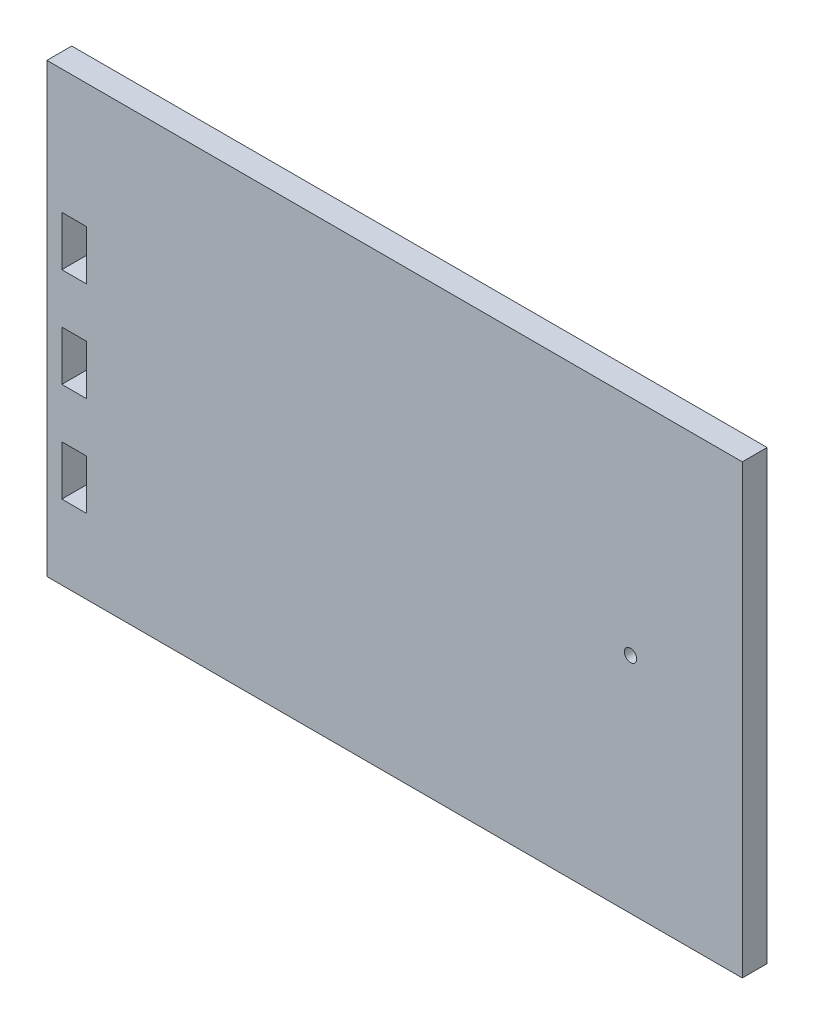
ISO-10303-21;
HEADER;
FILE_DESCRIPTION(('STEP AP214'),'2;1');
FILE_NAME('part.step','',(''),(''),'','','');
FILE_SCHEMA(('AUTOMOTIVE_DESIGN { 1 0 10303 214 1 1 1 1 }'));
ENDSEC;
DATA;
#1=APPLICATION_CONTEXT('core data for automotive mechanical design processes');
#2=APPLICATION_PROTOCOL_DEFINITION('international standard','automotive_design',2000,#1);
#3=PRODUCT_CONTEXT('',#1,'mechanical');
#4=PRODUCT('Part','Part','',(#3));
#5=PRODUCT_RELATED_PRODUCT_CATEGORY('part','',(#4));
#6=PRODUCT_DEFINITION_FORMATION('','',#4);
#7=PRODUCT_DEFINITION_CONTEXT('part definition',#1,'design');
#8=PRODUCT_DEFINITION('design','',#6,#7);
#9=PRODUCT_DEFINITION_SHAPE('','',#8);
#10=(LENGTH_UNIT() NAMED_UNIT(*) SI_UNIT(.MILLI.,.METRE.));
#11=(NAMED_UNIT(*) PLANE_ANGLE_UNIT() SI_UNIT($,.RADIAN.));
#12=(NAMED_UNIT(*) SI_UNIT($,.STERADIAN.) SOLID_ANGLE_UNIT());
#13=UNCERTAINTY_MEASURE_WITH_UNIT(LENGTH_MEASURE(1.E-05),#10,'distance_accuracy_value','');
#14=(GEOMETRIC_REPRESENTATION_CONTEXT(3) GLOBAL_UNCERTAINTY_ASSIGNED_CONTEXT((#13)) GLOBAL_UNIT_ASSIGNED_CONTEXT((#10,
#11,#12)) REPRESENTATION_CONTEXT('',''));
#15=CARTESIAN_POINT('',(0.,0.,0.));
#16=DIRECTION('',(0.,0.,1.));
#17=DIRECTION('',(1.,0.,0.));
#18=AXIS2_PLACEMENT_3D('',#15,#16,#17);
#19=CARTESIAN_POINT('',(0.,0.,12.7));
#20=DIRECTION('',(1.,0.,0.));
#21=DIRECTION('',(0.,1.,0.));
#22=AXIS2_PLACEMENT_3D('',#19,#20,#21);
#23=PLANE('',#22);
#24=DIRECTION('',(0.,-1.,0.));
#25=VECTOR('',#24,1.);
#26=CARTESIAN_POINT('',(0.,0.,0.));
#27=LINE('',#26,#25);
#28=CARTESIAN_POINT('',(0.,0.,0.));
#29=VERTEX_POINT('',#28);
#30=CARTESIAN_POINT('',(0.,-228.6,0.));
#31=VERTEX_POINT('',#30);
#32=EDGE_CURVE('E296',#29,#31,#27,.T.);
#33=ORIENTED_EDGE('',*,*,#32,.T.);
#34=DIRECTION('',(0.,0.,-1.));
#35=VECTOR('',#34,1.);
#36=CARTESIAN_POINT('',(0.,-228.6,12.7));
#37=LINE('',#36,#35);
#38=CARTESIAN_POINT('',(0.,-228.6,12.7));
#39=VERTEX_POINT('',#38);
#40=EDGE_CURVE('E11',#39,#31,#37,.T.);
#41=ORIENTED_EDGE('',*,*,#40,.F.);
#42=DIRECTION('',(0.,-1.,0.));
#43=VECTOR('',#42,1.);
#44=CARTESIAN_POINT('',(0.,0.,12.7));
#45=LINE('',#44,#43);
#46=CARTESIAN_POINT('',(0.,0.,12.7));
#47=VERTEX_POINT('',#46);
#48=EDGE_CURVE('E300',#47,#39,#45,.T.);
#49=ORIENTED_EDGE('',*,*,#48,.F.);
#50=DIRECTION('',(0.,0.,-1.));
#51=VECTOR('',#50,1.);
#52=CARTESIAN_POINT('',(0.,0.,12.7));
#53=LINE('',#52,#51);
#54=EDGE_CURVE('E314',#47,#29,#53,.T.);
#55=ORIENTED_EDGE('',*,*,#54,.T.);
#56=EDGE_LOOP('',(#33,#41,#49,#55));
#57=FACE_BOUND('',#56,.T.);
#58=ADVANCED_FACE('F42',(#57),#23,.F.);
#59=CARTESIAN_POINT('',(0.,-228.6,12.7));
#60=DIRECTION('',(0.,1.,0.));
#61=DIRECTION('',(0.,0.,1.));
#62=AXIS2_PLACEMENT_3D('',#59,#60,#61);
#63=PLANE('',#62);
#64=DIRECTION('',(1.,0.,0.));
#65=VECTOR('',#64,1.);
#66=CARTESIAN_POINT('',(0.,-228.6,0.));
#67=LINE('',#66,#65);
#68=CARTESIAN_POINT('',(355.6,-228.6,0.));
#69=VERTEX_POINT('',#68);
#70=EDGE_CURVE('E318',#31,#69,#67,.T.);
#71=ORIENTED_EDGE('',*,*,#70,.T.);
#72=DIRECTION('',(0.,0.,-1.));
#73=VECTOR('',#72,1.);
#74=CARTESIAN_POINT('',(355.6,-228.6,12.7));
#75=LINE('',#74,#73);
#76=CARTESIAN_POINT('',(355.6,-228.6,12.7));
#77=VERTEX_POINT('',#76);
#78=EDGE_CURVE('E50',#77,#69,#75,.T.);
#79=ORIENTED_EDGE('',*,*,#78,.F.);
#80=DIRECTION('',(1.,0.,0.));
#81=VECTOR('',#80,1.);
#82=CARTESIAN_POINT('',(0.,-228.6,12.7));
#83=LINE('',#82,#81);
#84=EDGE_CURVE('E304',#39,#77,#83,.T.);
#85=ORIENTED_EDGE('',*,*,#84,.F.);
#86=ORIENTED_EDGE('',*,*,#40,.T.);
#87=EDGE_LOOP('',(#71,#79,#85,#86));
#88=FACE_BOUND('',#87,.T.);
#89=ADVANCED_FACE('F353',(#88),#63,.F.);
#90=CARTESIAN_POINT('',(355.6,0.,12.7));
#91=DIRECTION('',(-1.,0.,0.));
#92=DIRECTION('',(0.,-1.,0.));
#93=AXIS2_PLACEMENT_3D('',#90,#91,#92);
#94=PLANE('',#93);
#95=DIRECTION('',(0.,1.,0.));
#96=VECTOR('',#95,1.);
#97=CARTESIAN_POINT('',(355.6,0.,0.));
#98=LINE('',#97,#96);
#99=CARTESIAN_POINT('',(355.6,0.,0.));
#100=VERTEX_POINT('',#99);
#101=EDGE_CURVE('E321',#69,#100,#98,.T.);
#102=ORIENTED_EDGE('',*,*,#101,.T.);
#103=DIRECTION('',(0.,0.,-1.));
#104=VECTOR('',#103,1.);
#105=CARTESIAN_POINT('',(355.6,0.,12.7));
#106=LINE('',#105,#104);
#107=CARTESIAN_POINT('',(355.6,0.,12.7));
#108=VERTEX_POINT('',#107);
#109=EDGE_CURVE('E329',#108,#100,#106,.T.);
#110=ORIENTED_EDGE('',*,*,#109,.F.);
#111=DIRECTION('',(0.,1.,0.));
#112=VECTOR('',#111,1.);
#113=CARTESIAN_POINT('',(355.6,0.,12.7));
#114=LINE('',#113,#112);
#115=EDGE_CURVE('E308',#77,#108,#114,.T.);
#116=ORIENTED_EDGE('',*,*,#115,.F.);
#117=ORIENTED_EDGE('',*,*,#78,.T.);
#118=EDGE_LOOP('',(#102,#110,#116,#117));
#119=FACE_BOUND('',#118,.T.);
#120=ADVANCED_FACE('F338',(#119),#94,.F.);
#121=CARTESIAN_POINT('',(0.,0.,12.7));
#122=DIRECTION('',(0.,-1.,0.));
#123=DIRECTION('',(0.,0.,-1.));
#124=AXIS2_PLACEMENT_3D('',#121,#122,#123);
#125=PLANE('',#124);
#126=DIRECTION('',(-1.,0.,0.));
#127=VECTOR('',#126,1.);
#128=CARTESIAN_POINT('',(0.,0.,0.));
#129=LINE('',#128,#127);
#130=EDGE_CURVE('E305',#100,#29,#129,.T.);
#131=ORIENTED_EDGE('',*,*,#130,.T.);
#132=ORIENTED_EDGE('',*,*,#54,.F.);
#133=DIRECTION('',(-1.,0.,0.));
#134=VECTOR('',#133,1.);
#135=CARTESIAN_POINT('',(0.,0.,12.7));
#136=LINE('',#135,#134);
#137=EDGE_CURVE('E311',#108,#47,#136,.T.);
#138=ORIENTED_EDGE('',*,*,#137,.F.);
#139=ORIENTED_EDGE('',*,*,#109,.T.);
#140=EDGE_LOOP('',(#131,#132,#138,#139));
#141=FACE_BOUND('',#140,.T.);
#142=ADVANCED_FACE('F346',(#141),#125,.F.);
#143=CARTESIAN_POINT('',(0.,0.,12.7));
#144=DIRECTION('',(0.,0.,1.));
#145=DIRECTION('',(1.,0.,0.));
#146=AXIS2_PLACEMENT_3D('',#143,#144,#145);
#147=PLANE('',#146);
#148=DIRECTION('',(1.,0.,0.));
#149=VECTOR('',#148,1.);
#150=CARTESIAN_POINT('',(7.62000000000001,-88.9,12.7));
#151=LINE('',#150,#149);
#152=CARTESIAN_POINT('',(7.62000000000001,-88.9,12.7));
#153=VERTEX_POINT('',#152);
#154=CARTESIAN_POINT('',(20.32,-88.9,12.7));
#155=VERTEX_POINT('',#154);
#156=EDGE_CURVE('E57',#153,#155,#151,.T.);
#157=ORIENTED_EDGE('',*,*,#156,.F.);
#158=DIRECTION('',(0.,-1.,0.));
#159=VECTOR('',#158,1.);
#160=CARTESIAN_POINT('',(7.62000000000001,-63.5,12.7));
#161=LINE('',#160,#159);
#162=CARTESIAN_POINT('',(7.62000000000001,-63.5,12.7));
#163=VERTEX_POINT('',#162);
#164=EDGE_CURVE('E180',#163,#153,#161,.T.);
#165=ORIENTED_EDGE('',*,*,#164,.F.);
#166=DIRECTION('',(1.,0.,0.));
#167=VECTOR('',#166,1.);
#168=CARTESIAN_POINT('',(7.62000000000001,-63.5,12.7));
#169=LINE('',#168,#167);
#170=CARTESIAN_POINT('',(20.32,-63.5,12.7));
#171=VERTEX_POINT('',#170);
#172=EDGE_CURVE('E184',#163,#171,#169,.T.);
#173=ORIENTED_EDGE('',*,*,#172,.T.);
#174=DIRECTION('',(0.,-1.,0.));
#175=VECTOR('',#174,1.);
#176=CARTESIAN_POINT('',(20.32,-63.5,12.7));
#177=LINE('',#176,#175);
#178=EDGE_CURVE('E193',#171,#155,#177,.T.);
#179=ORIENTED_EDGE('',*,*,#178,.T.);
#180=EDGE_LOOP('',(#157,#165,#173,#179));
#181=FACE_BOUND('',#180,.T.);
#182=DIRECTION('',(1.,0.,0.));
#183=VECTOR('',#182,1.);
#184=CARTESIAN_POINT('',(7.62000000000001,-139.7,12.7));
#185=LINE('',#184,#183);
#186=CARTESIAN_POINT('',(7.62000000000001,-139.7,12.7));
#187=VERTEX_POINT('',#186);
#188=CARTESIAN_POINT('',(20.32,-139.7,12.7));
#189=VERTEX_POINT('',#188);
#190=EDGE_CURVE('E65',#187,#189,#185,.T.);
#191=ORIENTED_EDGE('',*,*,#190,.F.);
#192=DIRECTION('',(0.,-1.,0.));
#193=VECTOR('',#192,1.);
#194=CARTESIAN_POINT('',(7.62000000000001,-114.3,12.7));
#195=LINE('',#194,#193);
#196=CARTESIAN_POINT('',(7.62000000000001,-114.3,12.7));
#197=VERTEX_POINT('',#196);
#198=EDGE_CURVE('E222',#197,#187,#195,.T.);
#199=ORIENTED_EDGE('',*,*,#198,.F.);
#200=DIRECTION('',(1.,0.,0.));
#201=VECTOR('',#200,1.);
#202=CARTESIAN_POINT('',(7.62000000000001,-114.3,12.7));
#203=LINE('',#202,#201);
#204=CARTESIAN_POINT('',(20.32,-114.3,12.7));
#205=VERTEX_POINT('',#204);
#206=EDGE_CURVE('E226',#197,#205,#203,.T.);
#207=ORIENTED_EDGE('',*,*,#206,.T.);
#208=DIRECTION('',(0.,-1.,0.));
#209=VECTOR('',#208,1.);
#210=CARTESIAN_POINT('',(20.32,-114.3,12.7));
#211=LINE('',#210,#209);
#212=EDGE_CURVE('E231',#205,#189,#211,.T.);
#213=ORIENTED_EDGE('',*,*,#212,.T.);
#214=EDGE_LOOP('',(#191,#199,#207,#213));
#215=FACE_BOUND('',#214,.T.);
#216=DIRECTION('',(1.,0.,0.));
#217=VECTOR('',#216,1.);
#218=CARTESIAN_POINT('',(7.62000000000002,-190.5,12.7));
#219=LINE('',#218,#217);
#220=CARTESIAN_POINT('',(7.62000000000002,-190.5,12.7));
#221=VERTEX_POINT('',#220);
#222=CARTESIAN_POINT('',(20.32,-190.5,12.7));
#223=VERTEX_POINT('',#222);
#224=EDGE_CURVE('E221',#221,#223,#219,.T.);
#225=ORIENTED_EDGE('',*,*,#224,.F.);
#226=DIRECTION('',(0.,-1.,0.));
#227=VECTOR('',#226,1.);
#228=CARTESIAN_POINT('',(7.62000000000001,-165.1,12.7));
#229=LINE('',#228,#227);
#230=CARTESIAN_POINT('',(7.62000000000001,-165.1,12.7));
#231=VERTEX_POINT('',#230);
#232=EDGE_CURVE('E264',#231,#221,#229,.T.);
#233=ORIENTED_EDGE('',*,*,#232,.F.);
#234=DIRECTION('',(1.,0.,0.));
#235=VECTOR('',#234,1.);
#236=CARTESIAN_POINT('',(7.62000000000001,-165.1,12.7));
#237=LINE('',#236,#235);
#238=CARTESIAN_POINT('',(20.32,-165.1,12.7));
#239=VERTEX_POINT('',#238);
#240=EDGE_CURVE('E268',#231,#239,#237,.T.);
#241=ORIENTED_EDGE('',*,*,#240,.T.);
#242=DIRECTION('',(0.,-1.,0.));
#243=VECTOR('',#242,1.);
#244=CARTESIAN_POINT('',(20.32,-165.1,12.7));
#245=LINE('',#244,#243);
#246=EDGE_CURVE('E273',#239,#223,#245,.T.);
#247=ORIENTED_EDGE('',*,*,#246,.T.);
#248=EDGE_LOOP('',(#225,#233,#241,#247));
#249=FACE_BOUND('',#248,.T.);
#250=CARTESIAN_POINT('',(298.45,-114.3,12.7));
#251=DIRECTION('',(0.,0.,1.));
#252=DIRECTION('',(1.,0.,0.));
#253=AXIS2_PLACEMENT_3D('',#250,#251,#252);
#254=CIRCLE('',#253,3.17499999999991);
#255=CARTESIAN_POINT('',(301.625,-114.3,12.7));
#256=VERTEX_POINT('',#255);
#257=EDGE_CURVE('E202',#256,#256,#254,.T.);
#258=ORIENTED_EDGE('',*,*,#257,.F.);
#259=EDGE_LOOP('',(#258));
#260=FACE_BOUND('',#259,.T.);
#261=ORIENTED_EDGE('',*,*,#48,.T.);
#262=ORIENTED_EDGE('',*,*,#84,.T.);
#263=ORIENTED_EDGE('',*,*,#115,.T.);
#264=ORIENTED_EDGE('',*,*,#137,.T.);
#265=EDGE_LOOP('',(#261,#262,#263,#264));
#266=FACE_BOUND('',#265,.T.);
#267=ADVANCED_FACE('F352',(#181,#215,#249,#260,#266),#147,.T.);
#268=CARTESIAN_POINT('',(0.,0.,0.));
#269=DIRECTION('',(0.,0.,1.));
#270=DIRECTION('',(1.,0.,0.));
#271=AXIS2_PLACEMENT_3D('',#268,#269,#270);
#272=PLANE('',#271);
#273=DIRECTION('',(0.,-1.,0.));
#274=VECTOR('',#273,1.);
#275=CARTESIAN_POINT('',(7.62000000000001,-63.5,0.));
#276=LINE('',#275,#274);
#277=CARTESIAN_POINT('',(7.62000000000001,-63.5,0.));
#278=VERTEX_POINT('',#277);
#279=CARTESIAN_POINT('',(7.62000000000001,-88.9,0.));
#280=VERTEX_POINT('',#279);
#281=EDGE_CURVE('E174',#278,#280,#276,.T.);
#282=ORIENTED_EDGE('',*,*,#281,.T.);
#283=DIRECTION('',(1.,0.,0.));
#284=VECTOR('',#283,1.);
#285=CARTESIAN_POINT('',(7.62000000000001,-88.9,0.));
#286=LINE('',#285,#284);
#287=CARTESIAN_POINT('',(20.32,-88.9,0.));
#288=VERTEX_POINT('',#287);
#289=EDGE_CURVE('E168',#280,#288,#286,.T.);
#290=ORIENTED_EDGE('',*,*,#289,.T.);
#291=DIRECTION('',(0.,-1.,0.));
#292=VECTOR('',#291,1.);
#293=CARTESIAN_POINT('',(20.32,-63.5,0.));
#294=LINE('',#293,#292);
#295=CARTESIAN_POINT('',(20.32,-63.5,0.));
#296=VERTEX_POINT('',#295);
#297=EDGE_CURVE('E156',#296,#288,#294,.T.);
#298=ORIENTED_EDGE('',*,*,#297,.F.);
#299=DIRECTION('',(1.,0.,0.));
#300=VECTOR('',#299,1.);
#301=CARTESIAN_POINT('',(7.62000000000001,-63.5,0.));
#302=LINE('',#301,#300);
#303=EDGE_CURVE('E167',#278,#296,#302,.T.);
#304=ORIENTED_EDGE('',*,*,#303,.F.);
#305=EDGE_LOOP('',(#282,#290,#298,#304));
#306=FACE_BOUND('',#305,.T.);
#307=DIRECTION('',(0.,-1.,0.));
#308=VECTOR('',#307,1.);
#309=CARTESIAN_POINT('',(7.62000000000001,-114.3,0.));
#310=LINE('',#309,#308);
#311=CARTESIAN_POINT('',(7.62000000000001,-114.3,0.));
#312=VERTEX_POINT('',#311);
#313=CARTESIAN_POINT('',(7.62000000000001,-139.7,0.));
#314=VERTEX_POINT('',#313);
#315=EDGE_CURVE('E211',#312,#314,#310,.T.);
#316=ORIENTED_EDGE('',*,*,#315,.T.);
#317=DIRECTION('',(1.,0.,0.));
#318=VECTOR('',#317,1.);
#319=CARTESIAN_POINT('',(7.62000000000001,-139.7,0.));
#320=LINE('',#319,#318);
#321=CARTESIAN_POINT('',(20.32,-139.7,0.));
#322=VERTEX_POINT('',#321);
#323=EDGE_CURVE('E227',#314,#322,#320,.T.);
#324=ORIENTED_EDGE('',*,*,#323,.T.);
#325=DIRECTION('',(0.,-1.,0.));
#326=VECTOR('',#325,1.);
#327=CARTESIAN_POINT('',(20.32,-114.3,0.));
#328=LINE('',#327,#326);
#329=CARTESIAN_POINT('',(20.32,-114.3,0.));
#330=VERTEX_POINT('',#329);
#331=EDGE_CURVE('E244',#330,#322,#328,.T.);
#332=ORIENTED_EDGE('',*,*,#331,.F.);
#333=DIRECTION('',(1.,0.,0.));
#334=VECTOR('',#333,1.);
#335=CARTESIAN_POINT('',(7.62000000000001,-114.3,0.));
#336=LINE('',#335,#334);
#337=EDGE_CURVE('E240',#312,#330,#336,.T.);
#338=ORIENTED_EDGE('',*,*,#337,.F.);
#339=EDGE_LOOP('',(#316,#324,#332,#338));
#340=FACE_BOUND('',#339,.T.);
#341=DIRECTION('',(0.,-1.,0.));
#342=VECTOR('',#341,1.);
#343=CARTESIAN_POINT('',(7.62000000000001,-165.1,0.));
#344=LINE('',#343,#342);
#345=CARTESIAN_POINT('',(7.62000000000001,-165.1,0.));
#346=VERTEX_POINT('',#345);
#347=CARTESIAN_POINT('',(7.62000000000002,-190.5,0.));
#348=VERTEX_POINT('',#347);
#349=EDGE_CURVE('E254',#346,#348,#344,.T.);
#350=ORIENTED_EDGE('',*,*,#349,.T.);
#351=DIRECTION('',(1.,0.,0.));
#352=VECTOR('',#351,1.);
#353=CARTESIAN_POINT('',(7.62000000000002,-190.5,0.));
#354=LINE('',#353,#352);
#355=CARTESIAN_POINT('',(20.32,-190.5,0.));
#356=VERTEX_POINT('',#355);
#357=EDGE_CURVE('E269',#348,#356,#354,.T.);
#358=ORIENTED_EDGE('',*,*,#357,.T.);
#359=DIRECTION('',(0.,-1.,0.));
#360=VECTOR('',#359,1.);
#361=CARTESIAN_POINT('',(20.32,-165.1,0.));
#362=LINE('',#361,#360);
#363=CARTESIAN_POINT('',(20.32,-165.1,0.));
#364=VERTEX_POINT('',#363);
#365=EDGE_CURVE('E286',#364,#356,#362,.T.);
#366=ORIENTED_EDGE('',*,*,#365,.F.);
#367=DIRECTION('',(1.,0.,0.));
#368=VECTOR('',#367,1.);
#369=CARTESIAN_POINT('',(7.62000000000001,-165.1,0.));
#370=LINE('',#369,#368);
#371=EDGE_CURVE('E282',#346,#364,#370,.T.);
#372=ORIENTED_EDGE('',*,*,#371,.F.);
#373=EDGE_LOOP('',(#350,#358,#366,#372));
#374=FACE_BOUND('',#373,.T.);
#375=CARTESIAN_POINT('',(298.45,-114.3,0.));
#376=DIRECTION('',(0.,0.,1.));
#377=DIRECTION('',(1.,0.,0.));
#378=AXIS2_PLACEMENT_3D('',#375,#376,#377);
#379=CIRCLE('',#378,3.17499999999991);
#380=CARTESIAN_POINT('',(301.625,-114.3,0.));
#381=VERTEX_POINT('',#380);
#382=EDGE_CURVE('E292',#381,#381,#379,.T.);
#383=ORIENTED_EDGE('',*,*,#382,.T.);
#384=EDGE_LOOP('',(#383));
#385=FACE_BOUND('',#384,.T.);
#386=ORIENTED_EDGE('',*,*,#32,.F.);
#387=ORIENTED_EDGE('',*,*,#130,.F.);
#388=ORIENTED_EDGE('',*,*,#101,.F.);
#389=ORIENTED_EDGE('',*,*,#70,.F.);
#390=EDGE_LOOP('',(#386,#387,#388,#389));
#391=FACE_BOUND('',#390,.T.);
#392=ADVANCED_FACE('F176',(#306,#340,#374,#385,#391),#272,.F.);
#393=CARTESIAN_POINT('',(298.45,-114.3,0.));
#394=DIRECTION('',(0.,0.,1.));
#395=DIRECTION('',(1.,0.,0.));
#396=AXIS2_PLACEMENT_3D('',#393,#394,#395);
#397=CYLINDRICAL_SURFACE('',#396,3.17499999999991);
#398=ORIENTED_EDGE('',*,*,#382,.F.);
#399=EDGE_LOOP('',(#398));
#400=FACE_BOUND('',#399,.T.);
#401=ORIENTED_EDGE('',*,*,#257,.T.);
#402=EDGE_LOOP('',(#401));
#403=FACE_BOUND('',#402,.T.);
#404=ADVANCED_FACE('F365',(#400,#403),#397,.F.);
#405=CARTESIAN_POINT('',(7.62000000000002,-190.5,0.));
#406=DIRECTION('',(0.,-1.,0.));
#407=DIRECTION('',(0.,0.,-1.));
#408=AXIS2_PLACEMENT_3D('',#405,#406,#407);
#409=PLANE('',#408);
#410=ORIENTED_EDGE('',*,*,#224,.T.);
#411=DIRECTION('',(0.,0.,1.));
#412=VECTOR('',#411,1.);
#413=CARTESIAN_POINT('',(20.32,-190.5,0.));
#414=LINE('',#413,#412);
#415=EDGE_CURVE('E250',#356,#223,#414,.T.);
#416=ORIENTED_EDGE('',*,*,#415,.F.);
#417=ORIENTED_EDGE('',*,*,#357,.F.);
#418=DIRECTION('',(0.,0.,1.));
#419=VECTOR('',#418,1.);
#420=CARTESIAN_POINT('',(7.62000000000002,-190.5,0.));
#421=LINE('',#420,#419);
#422=EDGE_CURVE('E261',#348,#221,#421,.T.);
#423=ORIENTED_EDGE('',*,*,#422,.T.);
#424=EDGE_LOOP('',(#410,#416,#417,#423));
#425=FACE_BOUND('',#424,.T.);
#426=ADVANCED_FACE('F371',(#425),#409,.F.);
#427=CARTESIAN_POINT('',(7.62000000000001,-165.1,0.));
#428=DIRECTION('',(-1.,0.,0.));
#429=DIRECTION('',(0.,-1.,0.));
#430=AXIS2_PLACEMENT_3D('',#427,#428,#429);
#431=PLANE('',#430);
#432=ORIENTED_EDGE('',*,*,#232,.T.);
#433=ORIENTED_EDGE('',*,*,#422,.F.);
#434=ORIENTED_EDGE('',*,*,#349,.F.);
#435=DIRECTION('',(0.,0.,1.));
#436=VECTOR('',#435,1.);
#437=CARTESIAN_POINT('',(7.62000000000001,-165.1,0.));
#438=LINE('',#437,#436);
#439=EDGE_CURVE('E258',#346,#231,#438,.T.);
#440=ORIENTED_EDGE('',*,*,#439,.T.);
#441=EDGE_LOOP('',(#432,#433,#434,#440));
#442=FACE_BOUND('',#441,.T.);
#443=ADVANCED_FACE('F373',(#442),#431,.F.);
#444=CARTESIAN_POINT('',(7.62000000000001,-165.1,0.));
#445=DIRECTION('',(0.,-1.,0.));
#446=DIRECTION('',(0.,0.,-1.));
#447=AXIS2_PLACEMENT_3D('',#444,#445,#446);
#448=PLANE('',#447);
#449=ORIENTED_EDGE('',*,*,#240,.F.);
#450=ORIENTED_EDGE('',*,*,#439,.F.);
#451=ORIENTED_EDGE('',*,*,#371,.T.);
#452=DIRECTION('',(0.,0.,1.));
#453=VECTOR('',#452,1.);
#454=CARTESIAN_POINT('',(20.32,-165.1,0.));
#455=LINE('',#454,#453);
#456=EDGE_CURVE('E255',#364,#239,#455,.T.);
#457=ORIENTED_EDGE('',*,*,#456,.T.);
#458=EDGE_LOOP('',(#449,#450,#451,#457));
#459=FACE_BOUND('',#458,.T.);
#460=ADVANCED_FACE('F376',(#459),#448,.T.);
#461=CARTESIAN_POINT('',(20.32,-165.1,0.));
#462=DIRECTION('',(-1.,0.,0.));
#463=DIRECTION('',(0.,-1.,0.));
#464=AXIS2_PLACEMENT_3D('',#461,#462,#463);
#465=PLANE('',#464);
#466=ORIENTED_EDGE('',*,*,#246,.F.);
#467=ORIENTED_EDGE('',*,*,#456,.F.);
#468=ORIENTED_EDGE('',*,*,#365,.T.);
#469=ORIENTED_EDGE('',*,*,#415,.T.);
#470=EDGE_LOOP('',(#466,#467,#468,#469));
#471=FACE_BOUND('',#470,.T.);
#472=ADVANCED_FACE('F380',(#471),#465,.T.);
#473=CARTESIAN_POINT('',(7.62000000000001,-139.7,0.));
#474=DIRECTION('',(0.,-1.,0.));
#475=DIRECTION('',(0.,0.,-1.));
#476=AXIS2_PLACEMENT_3D('',#473,#474,#475);
#477=PLANE('',#476);
#478=ORIENTED_EDGE('',*,*,#190,.T.);
#479=DIRECTION('',(0.,0.,1.));
#480=VECTOR('',#479,1.);
#481=CARTESIAN_POINT('',(20.32,-139.7,0.));
#482=LINE('',#481,#480);
#483=EDGE_CURVE('E208',#322,#189,#482,.T.);
#484=ORIENTED_EDGE('',*,*,#483,.F.);
#485=ORIENTED_EDGE('',*,*,#323,.F.);
#486=DIRECTION('',(0.,0.,1.));
#487=VECTOR('',#486,1.);
#488=CARTESIAN_POINT('',(7.62000000000001,-139.7,0.));
#489=LINE('',#488,#487);
#490=EDGE_CURVE('E218',#314,#187,#489,.T.);
#491=ORIENTED_EDGE('',*,*,#490,.T.);
#492=EDGE_LOOP('',(#478,#484,#485,#491));
#493=FACE_BOUND('',#492,.T.);
#494=ADVANCED_FACE('F384',(#493),#477,.F.);
#495=CARTESIAN_POINT('',(7.62000000000001,-114.3,0.));
#496=DIRECTION('',(-1.,0.,0.));
#497=DIRECTION('',(0.,-1.,0.));
#498=AXIS2_PLACEMENT_3D('',#495,#496,#497);
#499=PLANE('',#498);
#500=ORIENTED_EDGE('',*,*,#198,.T.);
#501=ORIENTED_EDGE('',*,*,#490,.F.);
#502=ORIENTED_EDGE('',*,*,#315,.F.);
#503=DIRECTION('',(0.,0.,1.));
#504=VECTOR('',#503,1.);
#505=CARTESIAN_POINT('',(7.62000000000001,-114.3,0.));
#506=LINE('',#505,#504);
#507=EDGE_CURVE('E215',#312,#197,#506,.T.);
#508=ORIENTED_EDGE('',*,*,#507,.T.);
#509=EDGE_LOOP('',(#500,#501,#502,#508));
#510=FACE_BOUND('',#509,.T.);
#511=ADVANCED_FACE('F389',(#510),#499,.F.);
#512=CARTESIAN_POINT('',(7.62000000000001,-114.3,0.));
#513=DIRECTION('',(0.,-1.,0.));
#514=DIRECTION('',(0.,0.,-1.));
#515=AXIS2_PLACEMENT_3D('',#512,#513,#514);
#516=PLANE('',#515);
#517=ORIENTED_EDGE('',*,*,#206,.F.);
#518=ORIENTED_EDGE('',*,*,#507,.F.);
#519=ORIENTED_EDGE('',*,*,#337,.T.);
#520=DIRECTION('',(0.,0.,1.));
#521=VECTOR('',#520,1.);
#522=CARTESIAN_POINT('',(20.32,-114.3,0.));
#523=LINE('',#522,#521);
#524=EDGE_CURVE('E212',#330,#205,#523,.T.);
#525=ORIENTED_EDGE('',*,*,#524,.T.);
#526=EDGE_LOOP('',(#517,#518,#519,#525));
#527=FACE_BOUND('',#526,.T.);
#528=ADVANCED_FACE('F392',(#527),#516,.T.);
#529=CARTESIAN_POINT('',(20.32,-114.3,0.));
#530=DIRECTION('',(-1.,0.,0.));
#531=DIRECTION('',(0.,-1.,0.));
#532=AXIS2_PLACEMENT_3D('',#529,#530,#531);
#533=PLANE('',#532);
#534=ORIENTED_EDGE('',*,*,#212,.F.);
#535=ORIENTED_EDGE('',*,*,#524,.F.);
#536=ORIENTED_EDGE('',*,*,#331,.T.);
#537=ORIENTED_EDGE('',*,*,#483,.T.);
#538=EDGE_LOOP('',(#534,#535,#536,#537));
#539=FACE_BOUND('',#538,.T.);
#540=ADVANCED_FACE('F396',(#539),#533,.T.);
#541=CARTESIAN_POINT('',(7.62000000000001,-88.9,0.));
#542=DIRECTION('',(0.,-1.,0.));
#543=DIRECTION('',(0.,0.,-1.));
#544=AXIS2_PLACEMENT_3D('',#541,#542,#543);
#545=PLANE('',#544);
#546=ORIENTED_EDGE('',*,*,#156,.T.);
#547=DIRECTION('',(0.,0.,1.));
#548=VECTOR('',#547,1.);
#549=CARTESIAN_POINT('',(20.32,-88.9,0.));
#550=LINE('',#549,#548);
#551=EDGE_CURVE('E159',#288,#155,#550,.T.);
#552=ORIENTED_EDGE('',*,*,#551,.F.);
#553=ORIENTED_EDGE('',*,*,#289,.F.);
#554=DIRECTION('',(0.,0.,1.));
#555=VECTOR('',#554,1.);
#556=CARTESIAN_POINT('',(7.62000000000001,-88.9,0.));
#557=LINE('',#556,#555);
#558=EDGE_CURVE('E199',#280,#153,#557,.T.);
#559=ORIENTED_EDGE('',*,*,#558,.T.);
#560=EDGE_LOOP('',(#546,#552,#553,#559));
#561=FACE_BOUND('',#560,.T.);
#562=ADVANCED_FACE('F171',(#561),#545,.F.);
#563=CARTESIAN_POINT('',(7.62000000000001,-63.5,0.));
#564=DIRECTION('',(-1.,0.,0.));
#565=DIRECTION('',(0.,-1.,0.));
#566=AXIS2_PLACEMENT_3D('',#563,#564,#565);
#567=PLANE('',#566);
#568=ORIENTED_EDGE('',*,*,#164,.T.);
#569=ORIENTED_EDGE('',*,*,#558,.F.);
#570=ORIENTED_EDGE('',*,*,#281,.F.);
#571=DIRECTION('',(0.,0.,1.));
#572=VECTOR('',#571,1.);
#573=CARTESIAN_POINT('',(7.62000000000001,-63.5,0.));
#574=LINE('',#573,#572);
#575=EDGE_CURVE('E203',#278,#163,#574,.T.);
#576=ORIENTED_EDGE('',*,*,#575,.T.);
#577=EDGE_LOOP('',(#568,#569,#570,#576));
#578=FACE_BOUND('',#577,.T.);
#579=ADVANCED_FACE('F405',(#578),#567,.F.);
#580=CARTESIAN_POINT('',(7.62000000000001,-63.5,0.));
#581=DIRECTION('',(0.,-1.,0.));
#582=DIRECTION('',(0.,0.,-1.));
#583=AXIS2_PLACEMENT_3D('',#580,#581,#582);
#584=PLANE('',#583);
#585=ORIENTED_EDGE('',*,*,#172,.F.);
#586=ORIENTED_EDGE('',*,*,#575,.F.);
#587=ORIENTED_EDGE('',*,*,#303,.T.);
#588=DIRECTION('',(0.,0.,1.));
#589=VECTOR('',#588,1.);
#590=CARTESIAN_POINT('',(20.32,-63.5,0.));
#591=LINE('',#590,#589);
#592=EDGE_CURVE('E161',#296,#171,#591,.T.);
#593=ORIENTED_EDGE('',*,*,#592,.T.);
#594=EDGE_LOOP('',(#585,#586,#587,#593));
#595=FACE_BOUND('',#594,.T.);
#596=ADVANCED_FACE('F408',(#595),#584,.T.);
#597=CARTESIAN_POINT('',(20.32,-63.5,0.));
#598=DIRECTION('',(-1.,0.,0.));
#599=DIRECTION('',(0.,-1.,0.));
#600=AXIS2_PLACEMENT_3D('',#597,#598,#599);
#601=PLANE('',#600);
#602=ORIENTED_EDGE('',*,*,#178,.F.);
#603=ORIENTED_EDGE('',*,*,#592,.F.);
#604=ORIENTED_EDGE('',*,*,#297,.T.);
#605=ORIENTED_EDGE('',*,*,#551,.T.);
#606=EDGE_LOOP('',(#602,#603,#604,#605));
#607=FACE_BOUND('',#606,.T.);
#608=ADVANCED_FACE('F158',(#607),#601,.T.);
#609=CLOSED_SHELL('',(#58,#89,#120,#142,#267,#392,#404,#426,#443,#460,#472,#494,#511,#528,#540,
#562,#579,#596,#608));
#610=MANIFOLD_SOLID_BREP('B2',#609);
#611=ADVANCED_BREP_SHAPE_REPRESENTATION('',(#18,#610),#14);
#612=SHAPE_DEFINITION_REPRESENTATION(#9,#611);
ENDSEC;
END-ISO-10303-21;
